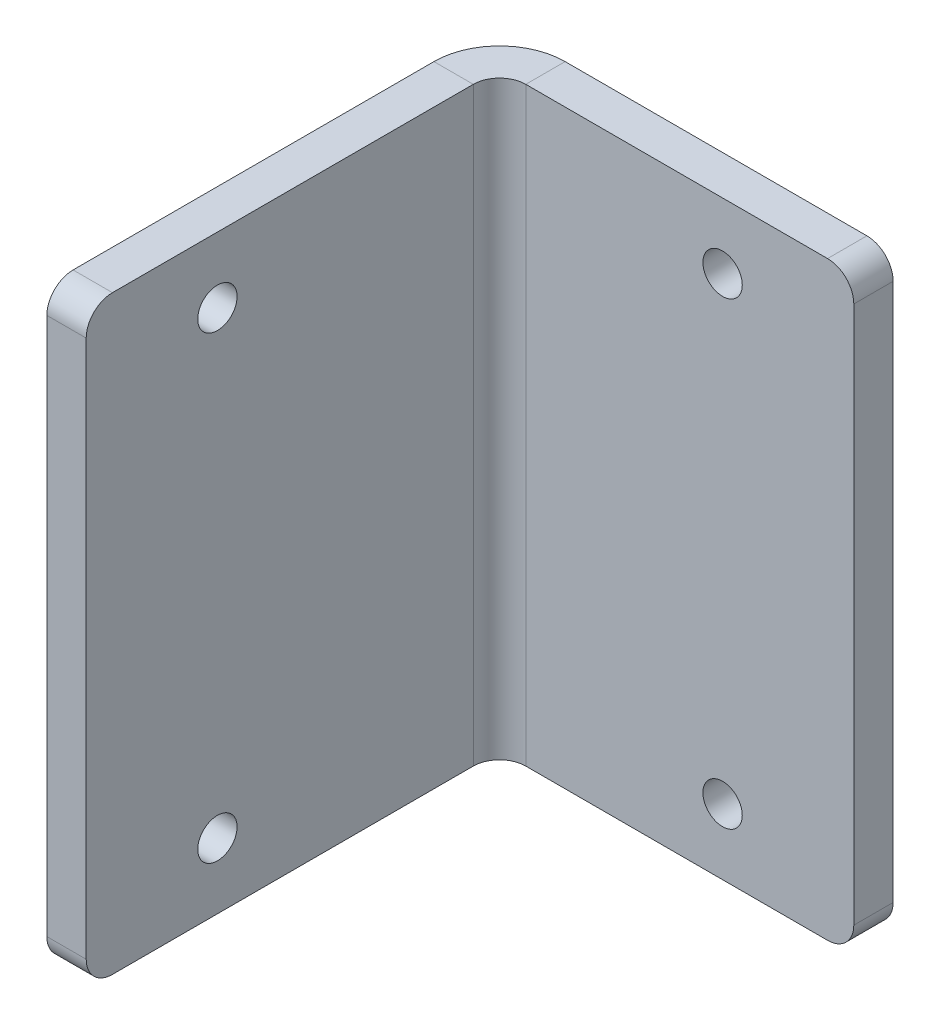
ISO-10303-21;
HEADER;
FILE_DESCRIPTION(('STEP AP214'),'2;1');
FILE_NAME('part.step','',(''),(''),'','','');
FILE_SCHEMA(('AUTOMOTIVE_DESIGN { 1 0 10303 214 1 1 1 1 }'));
ENDSEC;
DATA;
#1=APPLICATION_CONTEXT('core data for automotive mechanical design processes');
#2=APPLICATION_PROTOCOL_DEFINITION('international standard','automotive_design',2000,#1);
#3=PRODUCT_CONTEXT('',#1,'mechanical');
#4=PRODUCT('Part','Part','',(#3));
#5=PRODUCT_RELATED_PRODUCT_CATEGORY('part','',(#4));
#6=PRODUCT_DEFINITION_FORMATION('','',#4);
#7=PRODUCT_DEFINITION_CONTEXT('part definition',#1,'design');
#8=PRODUCT_DEFINITION('design','',#6,#7);
#9=PRODUCT_DEFINITION_SHAPE('','',#8);
#10=(LENGTH_UNIT() NAMED_UNIT(*) SI_UNIT(.MILLI.,.METRE.));
#11=(NAMED_UNIT(*) PLANE_ANGLE_UNIT() SI_UNIT($,.RADIAN.));
#12=(NAMED_UNIT(*) SI_UNIT($,.STERADIAN.) SOLID_ANGLE_UNIT());
#13=UNCERTAINTY_MEASURE_WITH_UNIT(LENGTH_MEASURE(1.E-05),#10,'distance_accuracy_value','');
#14=(GEOMETRIC_REPRESENTATION_CONTEXT(3) GLOBAL_UNCERTAINTY_ASSIGNED_CONTEXT((#13)) GLOBAL_UNIT_ASSIGNED_CONTEXT((#10,
#11,#12)) REPRESENTATION_CONTEXT('',''));
#15=CARTESIAN_POINT('',(0.,0.,0.));
#16=DIRECTION('',(0.,0.,1.));
#17=DIRECTION('',(1.,0.,0.));
#18=AXIS2_PLACEMENT_3D('',#15,#16,#17);
#19=CARTESIAN_POINT('',(33.,45.,34.5022128562178));
#20=DIRECTION('',(0.,-1.,0.));
#21=DIRECTION('',(0.,0.,1.));
#22=AXIS2_PLACEMENT_3D('',#19,#20,#21);
#23=PLANE('',#22);
#24=DIRECTION('',(0.,0.,1.));
#25=VECTOR('',#24,1.);
#26=CARTESIAN_POINT('',(33.,45.,34.5022128562178));
#27=LINE('',#26,#25);
#28=CARTESIAN_POINT('',(32.9999999999999,45.,5.));
#29=VERTEX_POINT('',#28);
#30=CARTESIAN_POINT('',(33.,45.,32.5022128562178));
#31=VERTEX_POINT('',#30);
#32=EDGE_CURVE('E41',#29,#31,#27,.T.);
#33=ORIENTED_EDGE('',*,*,#32,.F.);
#34=DIRECTION('',(-1.,0.,0.));
#35=VECTOR('',#34,1.);
#36=CARTESIAN_POINT('',(32.9999999999999,45.,5.));
#37=LINE('',#36,#35);
#38=CARTESIAN_POINT('',(29.9999999999999,45.,5.00000000000001));
#39=VERTEX_POINT('',#38);
#40=EDGE_CURVE('E12',#29,#39,#37,.T.);
#41=ORIENTED_EDGE('',*,*,#40,.T.);
#42=DIRECTION('',(0.,0.,1.));
#43=VECTOR('',#42,1.);
#44=CARTESIAN_POINT('',(30.,45.,34.5022128562178));
#45=LINE('',#44,#43);
#46=CARTESIAN_POINT('',(30.,45.,32.5022128562178));
#47=VERTEX_POINT('',#46);
#48=EDGE_CURVE('E54',#39,#47,#45,.T.);
#49=ORIENTED_EDGE('',*,*,#48,.T.);
#50=DIRECTION('',(1.,0.,0.));
#51=VECTOR('',#50,1.);
#52=CARTESIAN_POINT('',(33.,45.,32.5022128562178));
#53=LINE('',#52,#51);
#54=EDGE_CURVE('E154',#47,#31,#53,.T.);
#55=ORIENTED_EDGE('',*,*,#54,.T.);
#56=EDGE_LOOP('',(#33,#41,#49,#55));
#57=FACE_BOUND('',#56,.T.);
#58=ADVANCED_FACE('F38',(#57),#23,.F.);
#59=CARTESIAN_POINT('',(33.,0.,34.5022128562178));
#60=DIRECTION('',(0.,1.,0.));
#61=DIRECTION('',(0.,0.,-1.));
#62=AXIS2_PLACEMENT_3D('',#59,#60,#61);
#63=PLANE('',#62);
#64=DIRECTION('',(0.,0.,1.));
#65=VECTOR('',#64,1.);
#66=CARTESIAN_POINT('',(30.,0.,34.5022128562178));
#67=LINE('',#66,#65);
#68=CARTESIAN_POINT('',(30.,0.,32.5022128562178));
#69=VERTEX_POINT('',#68);
#70=CARTESIAN_POINT('',(29.9999999999999,0.,5.00000000000001));
#71=VERTEX_POINT('',#70);
#72=EDGE_CURVE('E61',#69,#71,#67,.F.);
#73=ORIENTED_EDGE('',*,*,#72,.T.);
#74=DIRECTION('',(1.,0.,0.));
#75=VECTOR('',#74,1.);
#76=CARTESIAN_POINT('',(32.9999999999999,0.,5.));
#77=LINE('',#76,#75);
#78=CARTESIAN_POINT('',(32.9999999999999,0.,5.00000000000001));
#79=VERTEX_POINT('',#78);
#80=EDGE_CURVE('E126',#71,#79,#77,.T.);
#81=ORIENTED_EDGE('',*,*,#80,.T.);
#82=DIRECTION('',(0.,0.,-1.));
#83=VECTOR('',#82,1.);
#84=CARTESIAN_POINT('',(33.,0.,34.5022128562178));
#85=LINE('',#84,#83);
#86=CARTESIAN_POINT('',(33.,0.,32.5022128562178));
#87=VERTEX_POINT('',#86);
#88=EDGE_CURVE('E129',#87,#79,#85,.T.);
#89=ORIENTED_EDGE('',*,*,#88,.F.);
#90=DIRECTION('',(1.,0.,0.));
#91=VECTOR('',#90,1.);
#92=CARTESIAN_POINT('',(33.,0.,32.5022128562178));
#93=LINE('',#92,#91);
#94=EDGE_CURVE('E238',#69,#87,#93,.T.);
#95=ORIENTED_EDGE('',*,*,#94,.F.);
#96=EDGE_LOOP('',(#73,#81,#89,#95));
#97=FACE_BOUND('',#96,.T.);
#98=ADVANCED_FACE('F128',(#97),#63,.F.);
#99=CARTESIAN_POINT('',(30.,0.,34.5022128562178));
#100=DIRECTION('',(-1.,0.,0.));
#101=DIRECTION('',(0.,0.,1.));
#102=AXIS2_PLACEMENT_3D('',#99,#100,#101);
#103=PLANE('',#102);
#104=CARTESIAN_POINT('',(30.,4.99999999999773,24.5022128562223));
#105=DIRECTION('',(1.,0.,0.));
#106=DIRECTION('',(0.,0.,-1.));
#107=AXIS2_PLACEMENT_3D('',#104,#105,#106);
#108=CIRCLE('',#107,1.5);
#109=CARTESIAN_POINT('',(30.,4.99999999999773,23.0022128562223));
#110=VERTEX_POINT('',#109);
#111=EDGE_CURVE('E174',#110,#110,#108,.T.);
#112=ORIENTED_EDGE('',*,*,#111,.T.);
#113=EDGE_LOOP('',(#112));
#114=FACE_BOUND('',#113,.T.);
#115=CARTESIAN_POINT('',(30.,39.999999999996,24.5022128562223));
#116=DIRECTION('',(1.,0.,0.));
#117=DIRECTION('',(0.,0.,-1.));
#118=AXIS2_PLACEMENT_3D('',#115,#116,#117);
#119=CIRCLE('',#118,1.5);
#120=CARTESIAN_POINT('',(30.,39.999999999996,23.0022128562223));
#121=VERTEX_POINT('',#120);
#122=EDGE_CURVE('E241',#121,#121,#119,.T.);
#123=ORIENTED_EDGE('',*,*,#122,.T.);
#124=EDGE_LOOP('',(#123));
#125=FACE_BOUND('',#124,.T.);
#126=ORIENTED_EDGE('',*,*,#48,.F.);
#127=DIRECTION('',(0.,-1.,0.));
#128=VECTOR('',#127,1.);
#129=CARTESIAN_POINT('',(29.9999999999999,0.,5.00000000000001));
#130=LINE('',#129,#128);
#131=EDGE_CURVE('E46',#39,#71,#130,.T.);
#132=ORIENTED_EDGE('',*,*,#131,.T.);
#133=ORIENTED_EDGE('',*,*,#72,.F.);
#134=CARTESIAN_POINT('',(30.,2.,32.5022128562178));
#135=DIRECTION('',(-1.,0.,0.));
#136=DIRECTION('',(0.,0.,1.));
#137=AXIS2_PLACEMENT_3D('',#134,#135,#136);
#138=CIRCLE('',#137,2.);
#139=CARTESIAN_POINT('',(30.,2.,34.5022128562178));
#140=VERTEX_POINT('',#139);
#141=EDGE_CURVE('E229',#140,#69,#138,.F.);
#142=ORIENTED_EDGE('',*,*,#141,.F.);
#143=DIRECTION('',(0.,1.,0.));
#144=VECTOR('',#143,1.);
#145=CARTESIAN_POINT('',(30.,0.,34.5022128562178));
#146=LINE('',#145,#144);
#147=CARTESIAN_POINT('',(30.,43.,34.5022128562178));
#148=VERTEX_POINT('',#147);
#149=EDGE_CURVE('E246',#148,#140,#146,.F.);
#150=ORIENTED_EDGE('',*,*,#149,.F.);
#151=CARTESIAN_POINT('',(30.,43.,32.5022128562178));
#152=DIRECTION('',(-1.,0.,0.));
#153=DIRECTION('',(0.,0.,1.));
#154=AXIS2_PLACEMENT_3D('',#151,#152,#153);
#155=CIRCLE('',#154,2.);
#156=EDGE_CURVE('E249',#47,#148,#155,.F.);
#157=ORIENTED_EDGE('',*,*,#156,.F.);
#158=EDGE_LOOP('',(#126,#132,#133,#142,#150,#157));
#159=FACE_BOUND('',#158,.T.);
#160=ADVANCED_FACE('F269',(#114,#125,#159),#103,.T.);
#161=CARTESIAN_POINT('',(33.,43.,32.5022128562178));
#162=DIRECTION('',(-1.,0.,0.));
#163=DIRECTION('',(0.,0.,1.));
#164=AXIS2_PLACEMENT_3D('',#161,#162,#163);
#165=CYLINDRICAL_SURFACE('',#164,2.);
#166=ORIENTED_EDGE('',*,*,#54,.F.);
#167=ORIENTED_EDGE('',*,*,#156,.T.);
#168=DIRECTION('',(1.,0.,0.));
#169=VECTOR('',#168,1.);
#170=CARTESIAN_POINT('',(33.,43.,34.5022128562178));
#171=LINE('',#170,#169);
#172=CARTESIAN_POINT('',(33.,43.,34.5022128562178));
#173=VERTEX_POINT('',#172);
#174=EDGE_CURVE('E255',#148,#173,#171,.T.);
#175=ORIENTED_EDGE('',*,*,#174,.T.);
#176=CARTESIAN_POINT('',(33.,43.,32.5022128562178));
#177=DIRECTION('',(-1.,0.,0.));
#178=DIRECTION('',(0.,0.,1.));
#179=AXIS2_PLACEMENT_3D('',#176,#177,#178);
#180=CIRCLE('',#179,2.);
#181=EDGE_CURVE('E232',#31,#173,#180,.F.);
#182=ORIENTED_EDGE('',*,*,#181,.F.);
#183=EDGE_LOOP('',(#166,#167,#175,#182));
#184=FACE_BOUND('',#183,.T.);
#185=ADVANCED_FACE('F267',(#184),#165,.T.);
#186=CARTESIAN_POINT('',(33.,0.,34.5022128562178));
#187=DIRECTION('',(0.,0.,-1.));
#188=DIRECTION('',(0.,-1.,0.));
#189=AXIS2_PLACEMENT_3D('',#186,#187,#188);
#190=PLANE('',#189);
#191=ORIENTED_EDGE('',*,*,#174,.F.);
#192=ORIENTED_EDGE('',*,*,#149,.T.);
#193=DIRECTION('',(1.,0.,0.));
#194=VECTOR('',#193,1.);
#195=CARTESIAN_POINT('',(33.,2.,34.5022128562178));
#196=LINE('',#195,#194);
#197=CARTESIAN_POINT('',(33.,2.,34.5022128562178));
#198=VERTEX_POINT('',#197);
#199=EDGE_CURVE('E253',#140,#198,#196,.T.);
#200=ORIENTED_EDGE('',*,*,#199,.T.);
#201=DIRECTION('',(0.,-1.,0.));
#202=VECTOR('',#201,1.);
#203=CARTESIAN_POINT('',(33.,0.,34.5022128562178));
#204=LINE('',#203,#202);
#205=EDGE_CURVE('E235',#173,#198,#204,.T.);
#206=ORIENTED_EDGE('',*,*,#205,.F.);
#207=EDGE_LOOP('',(#191,#192,#200,#206));
#208=FACE_BOUND('',#207,.T.);
#209=ADVANCED_FACE('F272',(#208),#190,.F.);
#210=CARTESIAN_POINT('',(33.,2.,32.5022128562178));
#211=DIRECTION('',(-1.,0.,0.));
#212=DIRECTION('',(0.,0.,1.));
#213=AXIS2_PLACEMENT_3D('',#210,#211,#212);
#214=CYLINDRICAL_SURFACE('',#213,2.);
#215=ORIENTED_EDGE('',*,*,#199,.F.);
#216=ORIENTED_EDGE('',*,*,#141,.T.);
#217=ORIENTED_EDGE('',*,*,#94,.T.);
#218=CARTESIAN_POINT('',(33.,2.,32.5022128562178));
#219=DIRECTION('',(-1.,0.,0.));
#220=DIRECTION('',(0.,0.,1.));
#221=AXIS2_PLACEMENT_3D('',#218,#219,#220);
#222=CIRCLE('',#221,2.);
#223=EDGE_CURVE('E144',#198,#87,#222,.F.);
#224=ORIENTED_EDGE('',*,*,#223,.F.);
#225=EDGE_LOOP('',(#215,#216,#217,#224));
#226=FACE_BOUND('',#225,.T.);
#227=ADVANCED_FACE('F282',(#226),#214,.T.);
#228=CARTESIAN_POINT('',(33.,4.99999999999773,24.5022128562223));
#229=DIRECTION('',(1.,0.,0.));
#230=DIRECTION('',(0.,0.,-1.));
#231=AXIS2_PLACEMENT_3D('',#228,#229,#230);
#232=CYLINDRICAL_SURFACE('',#231,1.5);
#233=CARTESIAN_POINT('',(33.,4.99999999999773,24.5022128562223));
#234=DIRECTION('',(1.,0.,0.));
#235=DIRECTION('',(0.,0.,-1.));
#236=AXIS2_PLACEMENT_3D('',#233,#234,#235);
#237=CIRCLE('',#236,1.5);
#238=CARTESIAN_POINT('',(33.,4.99999999999773,23.0022128562223));
#239=VERTEX_POINT('',#238);
#240=EDGE_CURVE('E226',#239,#239,#237,.T.);
#241=ORIENTED_EDGE('',*,*,#240,.T.);
#242=EDGE_LOOP('',(#241));
#243=FACE_BOUND('',#242,.T.);
#244=ORIENTED_EDGE('',*,*,#111,.F.);
#245=EDGE_LOOP('',(#244));
#246=FACE_BOUND('',#245,.T.);
#247=ADVANCED_FACE('F284',(#243,#246),#232,.F.);
#248=CARTESIAN_POINT('',(33.,39.999999999996,24.5022128562223));
#249=DIRECTION('',(1.,0.,0.));
#250=DIRECTION('',(0.,0.,-1.));
#251=AXIS2_PLACEMENT_3D('',#248,#249,#250);
#252=CYLINDRICAL_SURFACE('',#251,1.5);
#253=CARTESIAN_POINT('',(33.,39.999999999996,24.5022128562223));
#254=DIRECTION('',(1.,0.,0.));
#255=DIRECTION('',(0.,0.,-1.));
#256=AXIS2_PLACEMENT_3D('',#253,#254,#255);
#257=CIRCLE('',#256,1.5);
#258=CARTESIAN_POINT('',(33.,39.999999999996,23.0022128562223));
#259=VERTEX_POINT('',#258);
#260=EDGE_CURVE('E145',#259,#259,#257,.T.);
#261=ORIENTED_EDGE('',*,*,#260,.T.);
#262=EDGE_LOOP('',(#261));
#263=FACE_BOUND('',#262,.T.);
#264=ORIENTED_EDGE('',*,*,#122,.F.);
#265=EDGE_LOOP('',(#264));
#266=FACE_BOUND('',#265,.T.);
#267=ADVANCED_FACE('F290',(#263,#266),#252,.F.);
#268=CARTESIAN_POINT('',(33.,0.,34.5022128562178));
#269=DIRECTION('',(-1.,0.,0.));
#270=DIRECTION('',(0.,0.,1.));
#271=AXIS2_PLACEMENT_3D('',#268,#269,#270);
#272=PLANE('',#271);
#273=DIRECTION('',(0.,-1.,0.));
#274=VECTOR('',#273,1.);
#275=CARTESIAN_POINT('',(32.9999999999999,0.,5.));
#276=LINE('',#275,#274);
#277=EDGE_CURVE('E135',#29,#79,#276,.T.);
#278=ORIENTED_EDGE('',*,*,#277,.F.);
#279=ORIENTED_EDGE('',*,*,#32,.T.);
#280=ORIENTED_EDGE('',*,*,#181,.T.);
#281=ORIENTED_EDGE('',*,*,#205,.T.);
#282=ORIENTED_EDGE('',*,*,#223,.T.);
#283=ORIENTED_EDGE('',*,*,#88,.T.);
#284=EDGE_LOOP('',(#278,#279,#280,#281,#282,#283));
#285=FACE_BOUND('',#284,.T.);
#286=ORIENTED_EDGE('',*,*,#240,.F.);
#287=EDGE_LOOP('',(#286));
#288=FACE_BOUND('',#287,.T.);
#289=ORIENTED_EDGE('',*,*,#260,.F.);
#290=EDGE_LOOP('',(#289));
#291=FACE_BOUND('',#290,.T.);
#292=ADVANCED_FACE('F139',(#285,#288,#291),#272,.F.);
#293=CARTESIAN_POINT('',(57.9999999999999,43.,3.));
#294=DIRECTION('',(0.,0.,-1.));
#295=DIRECTION('',(-1.,0.,0.));
#296=AXIS2_PLACEMENT_3D('',#293,#294,#295);
#297=CYLINDRICAL_SURFACE('',#296,2.);
#298=DIRECTION('',(0.,0.,1.));
#299=VECTOR('',#298,1.);
#300=CARTESIAN_POINT('',(59.9999999999999,43.,3.));
#301=LINE('',#300,#299);
#302=CARTESIAN_POINT('',(59.9999999999999,43.,0.));
#303=VERTEX_POINT('',#302);
#304=CARTESIAN_POINT('',(59.9999999999999,43.,3.));
#305=VERTEX_POINT('',#304);
#306=EDGE_CURVE('E213',#303,#305,#301,.T.);
#307=ORIENTED_EDGE('',*,*,#306,.F.);
#308=CARTESIAN_POINT('',(57.9999999999999,43.,0.));
#309=DIRECTION('',(0.,0.,-1.));
#310=DIRECTION('',(-1.,0.,0.));
#311=AXIS2_PLACEMENT_3D('',#308,#309,#310);
#312=CIRCLE('',#311,2.);
#313=CARTESIAN_POINT('',(57.9999999999999,45.,0.));
#314=VERTEX_POINT('',#313);
#315=EDGE_CURVE('E220',#303,#314,#312,.F.);
#316=ORIENTED_EDGE('',*,*,#315,.T.);
#317=DIRECTION('',(0.,0.,1.));
#318=VECTOR('',#317,1.);
#319=CARTESIAN_POINT('',(57.9999999999999,45.,3.));
#320=LINE('',#319,#318);
#321=CARTESIAN_POINT('',(57.9999999999999,45.,3.));
#322=VERTEX_POINT('',#321);
#323=EDGE_CURVE('E218',#314,#322,#320,.T.);
#324=ORIENTED_EDGE('',*,*,#323,.T.);
#325=CARTESIAN_POINT('',(57.9999999999999,43.,3.));
#326=DIRECTION('',(0.,0.,-1.));
#327=DIRECTION('',(-1.,0.,0.));
#328=AXIS2_PLACEMENT_3D('',#325,#326,#327);
#329=CIRCLE('',#328,2.);
#330=EDGE_CURVE('E186',#305,#322,#329,.F.);
#331=ORIENTED_EDGE('',*,*,#330,.F.);
#332=EDGE_LOOP('',(#307,#316,#324,#331));
#333=FACE_BOUND('',#332,.T.);
#334=ADVANCED_FACE('F309',(#333),#297,.T.);
#335=CARTESIAN_POINT('',(59.9999999999999,0.,3.));
#336=DIRECTION('',(-1.,0.,0.));
#337=DIRECTION('',(0.,1.,0.));
#338=AXIS2_PLACEMENT_3D('',#335,#336,#337);
#339=PLANE('',#338);
#340=DIRECTION('',(0.,0.,1.));
#341=VECTOR('',#340,1.);
#342=CARTESIAN_POINT('',(59.9999999999999,2.,3.));
#343=LINE('',#342,#341);
#344=CARTESIAN_POINT('',(59.9999999999999,2.,0.));
#345=VERTEX_POINT('',#344);
#346=CARTESIAN_POINT('',(59.9999999999999,2.,3.));
#347=VERTEX_POINT('',#346);
#348=EDGE_CURVE('E208',#345,#347,#343,.T.);
#349=ORIENTED_EDGE('',*,*,#348,.F.);
#350=DIRECTION('',(0.,1.,0.));
#351=VECTOR('',#350,1.);
#352=CARTESIAN_POINT('',(59.9999999999999,0.,0.));
#353=LINE('',#352,#351);
#354=EDGE_CURVE('E215',#345,#303,#353,.T.);
#355=ORIENTED_EDGE('',*,*,#354,.T.);
#356=ORIENTED_EDGE('',*,*,#306,.T.);
#357=DIRECTION('',(0.,1.,0.));
#358=VECTOR('',#357,1.);
#359=CARTESIAN_POINT('',(59.9999999999999,0.,3.));
#360=LINE('',#359,#358);
#361=EDGE_CURVE('E189',#347,#305,#360,.T.);
#362=ORIENTED_EDGE('',*,*,#361,.F.);
#363=EDGE_LOOP('',(#349,#355,#356,#362));
#364=FACE_BOUND('',#363,.T.);
#365=ADVANCED_FACE('F355',(#364),#339,.F.);
#366=CARTESIAN_POINT('',(57.9999999999999,2.,3.));
#367=DIRECTION('',(0.,0.,-1.));
#368=DIRECTION('',(-1.,0.,0.));
#369=AXIS2_PLACEMENT_3D('',#366,#367,#368);
#370=CYLINDRICAL_SURFACE('',#369,2.);
#371=CARTESIAN_POINT('',(57.9999999999999,2.,0.));
#372=DIRECTION('',(0.,0.,-1.));
#373=DIRECTION('',(-1.,0.,0.));
#374=AXIS2_PLACEMENT_3D('',#371,#372,#373);
#375=CIRCLE('',#374,2.);
#376=CARTESIAN_POINT('',(57.9999999999999,0.,0.));
#377=VERTEX_POINT('',#376);
#378=EDGE_CURVE('E210',#377,#345,#375,.F.);
#379=ORIENTED_EDGE('',*,*,#378,.T.);
#380=ORIENTED_EDGE('',*,*,#348,.T.);
#381=CARTESIAN_POINT('',(57.9999999999999,2.,3.));
#382=DIRECTION('',(0.,0.,-1.));
#383=DIRECTION('',(-1.,0.,0.));
#384=AXIS2_PLACEMENT_3D('',#381,#382,#383);
#385=CIRCLE('',#384,2.);
#386=CARTESIAN_POINT('',(57.9999999999999,0.,3.));
#387=VERTEX_POINT('',#386);
#388=EDGE_CURVE('E192',#387,#347,#385,.F.);
#389=ORIENTED_EDGE('',*,*,#388,.F.);
#390=DIRECTION('',(0.,0.,1.));
#391=VECTOR('',#390,1.);
#392=CARTESIAN_POINT('',(57.9999999999999,0.,3.));
#393=LINE('',#392,#391);
#394=EDGE_CURVE('E181',#377,#387,#393,.T.);
#395=ORIENTED_EDGE('',*,*,#394,.F.);
#396=EDGE_LOOP('',(#379,#380,#389,#395));
#397=FACE_BOUND('',#396,.T.);
#398=ADVANCED_FACE('F367',(#397),#370,.T.);
#399=CARTESIAN_POINT('',(50.0000000000085,5.,3.));
#400=DIRECTION('',(0.,0.,1.));
#401=DIRECTION('',(1.,0.,0.));
#402=AXIS2_PLACEMENT_3D('',#399,#400,#401);
#403=CYLINDRICAL_SURFACE('',#402,1.5);
#404=CARTESIAN_POINT('',(50.0000000000085,5.,3.));
#405=DIRECTION('',(0.,0.,1.));
#406=DIRECTION('',(1.,0.,0.));
#407=AXIS2_PLACEMENT_3D('',#404,#405,#406);
#408=CIRCLE('',#407,1.5);
#409=CARTESIAN_POINT('',(51.5000000000085,5.,3.));
#410=VERTEX_POINT('',#409);
#411=EDGE_CURVE('E205',#410,#410,#408,.T.);
#412=ORIENTED_EDGE('',*,*,#411,.T.);
#413=EDGE_LOOP('',(#412));
#414=FACE_BOUND('',#413,.T.);
#415=CARTESIAN_POINT('',(50.0000000000085,5.,0.));
#416=DIRECTION('',(0.,0.,1.));
#417=DIRECTION('',(1.,0.,0.));
#418=AXIS2_PLACEMENT_3D('',#415,#416,#417);
#419=CIRCLE('',#418,1.5);
#420=CARTESIAN_POINT('',(51.5000000000085,5.,0.));
#421=VERTEX_POINT('',#420);
#422=EDGE_CURVE('E178',#421,#421,#419,.T.);
#423=ORIENTED_EDGE('',*,*,#422,.F.);
#424=EDGE_LOOP('',(#423));
#425=FACE_BOUND('',#424,.T.);
#426=ADVANCED_FACE('F378',(#414,#425),#403,.F.);
#427=CARTESIAN_POINT('',(50.0000000000056,39.999999999996,3.));
#428=DIRECTION('',(0.,0.,1.));
#429=DIRECTION('',(1.,0.,0.));
#430=AXIS2_PLACEMENT_3D('',#427,#428,#429);
#431=CYLINDRICAL_SURFACE('',#430,1.5);
#432=CARTESIAN_POINT('',(50.0000000000056,39.999999999996,3.));
#433=DIRECTION('',(0.,0.,1.));
#434=DIRECTION('',(1.,0.,0.));
#435=AXIS2_PLACEMENT_3D('',#432,#433,#434);
#436=CIRCLE('',#435,1.5);
#437=CARTESIAN_POINT('',(51.5000000000057,39.999999999996,3.));
#438=VERTEX_POINT('',#437);
#439=EDGE_CURVE('E202',#438,#438,#436,.T.);
#440=ORIENTED_EDGE('',*,*,#439,.T.);
#441=EDGE_LOOP('',(#440));
#442=FACE_BOUND('',#441,.T.);
#443=CARTESIAN_POINT('',(50.0000000000056,39.999999999996,0.));
#444=DIRECTION('',(0.,0.,1.));
#445=DIRECTION('',(1.,0.,0.));
#446=AXIS2_PLACEMENT_3D('',#443,#444,#445);
#447=CIRCLE('',#446,1.5);
#448=CARTESIAN_POINT('',(51.5000000000057,39.999999999996,0.));
#449=VERTEX_POINT('',#448);
#450=EDGE_CURVE('E175',#449,#449,#447,.T.);
#451=ORIENTED_EDGE('',*,*,#450,.F.);
#452=EDGE_LOOP('',(#451));
#453=FACE_BOUND('',#452,.T.);
#454=ADVANCED_FACE('F389',(#442,#453),#431,.F.);
#455=CARTESIAN_POINT('',(0.,0.,3.));
#456=DIRECTION('',(0.,0.,-1.));
#457=DIRECTION('',(-1.,0.,0.));
#458=AXIS2_PLACEMENT_3D('',#455,#456,#457);
#459=PLANE('',#458);
#460=ORIENTED_EDGE('',*,*,#439,.F.);
#461=EDGE_LOOP('',(#460));
#462=FACE_BOUND('',#461,.T.);
#463=ORIENTED_EDGE('',*,*,#411,.F.);
#464=EDGE_LOOP('',(#463));
#465=FACE_BOUND('',#464,.T.);
#466=DIRECTION('',(-1.,0.,0.));
#467=VECTOR('',#466,1.);
#468=CARTESIAN_POINT('',(0.,45.,3.));
#469=LINE('',#468,#467);
#470=CARTESIAN_POINT('',(34.9999999999999,45.,3.));
#471=VERTEX_POINT('',#470);
#472=EDGE_CURVE('E200',#322,#471,#469,.T.);
#473=ORIENTED_EDGE('',*,*,#472,.T.);
#474=DIRECTION('',(0.,-1.,0.));
#475=VECTOR('',#474,1.);
#476=CARTESIAN_POINT('',(34.9999999999999,0.,3.));
#477=LINE('',#476,#475);
#478=CARTESIAN_POINT('',(34.9999999999999,0.,3.));
#479=VERTEX_POINT('',#478);
#480=EDGE_CURVE('E197',#471,#479,#477,.T.);
#481=ORIENTED_EDGE('',*,*,#480,.T.);
#482=DIRECTION('',(1.,0.,0.));
#483=VECTOR('',#482,1.);
#484=CARTESIAN_POINT('',(0.,0.,3.));
#485=LINE('',#484,#483);
#486=EDGE_CURVE('E195',#479,#387,#485,.T.);
#487=ORIENTED_EDGE('',*,*,#486,.T.);
#488=ORIENTED_EDGE('',*,*,#388,.T.);
#489=ORIENTED_EDGE('',*,*,#361,.T.);
#490=ORIENTED_EDGE('',*,*,#330,.T.);
#491=EDGE_LOOP('',(#473,#481,#487,#488,#489,#490));
#492=FACE_BOUND('',#491,.T.);
#493=ADVANCED_FACE('F400',(#462,#465,#492),#459,.F.);
#494=CARTESIAN_POINT('',(0.,0.,3.));
#495=DIRECTION('',(0.,1.,0.));
#496=DIRECTION('',(1.,0.,0.));
#497=AXIS2_PLACEMENT_3D('',#494,#495,#496);
#498=PLANE('',#497);
#499=DIRECTION('',(0.,0.,1.));
#500=VECTOR('',#499,1.);
#501=CARTESIAN_POINT('',(34.9999999999999,0.,3.));
#502=LINE('',#501,#500);
#503=CARTESIAN_POINT('',(34.9999999999999,0.,0.));
#504=VERTEX_POINT('',#503);
#505=EDGE_CURVE('E159',#504,#479,#502,.T.);
#506=ORIENTED_EDGE('',*,*,#505,.F.);
#507=DIRECTION('',(-1.,0.,0.));
#508=VECTOR('',#507,1.);
#509=CARTESIAN_POINT('',(0.,0.,0.));
#510=LINE('',#509,#508);
#511=EDGE_CURVE('E184',#504,#377,#510,.F.);
#512=ORIENTED_EDGE('',*,*,#511,.T.);
#513=ORIENTED_EDGE('',*,*,#394,.T.);
#514=ORIENTED_EDGE('',*,*,#486,.F.);
#515=EDGE_LOOP('',(#506,#512,#513,#514));
#516=FACE_BOUND('',#515,.T.);
#517=ADVANCED_FACE('F411',(#516),#498,.F.);
#518=CARTESIAN_POINT('',(0.,0.,0.));
#519=DIRECTION('',(0.,0.,-1.));
#520=DIRECTION('',(-1.,0.,0.));
#521=AXIS2_PLACEMENT_3D('',#518,#519,#520);
#522=PLANE('',#521);
#523=DIRECTION('',(0.,-1.,0.));
#524=VECTOR('',#523,1.);
#525=CARTESIAN_POINT('',(34.9999999999999,0.,0.));
#526=LINE('',#525,#524);
#527=CARTESIAN_POINT('',(34.9999999999999,45.,0.));
#528=VERTEX_POINT('',#527);
#529=EDGE_CURVE('E163',#528,#504,#526,.T.);
#530=ORIENTED_EDGE('',*,*,#529,.F.);
#531=DIRECTION('',(-1.,0.,0.));
#532=VECTOR('',#531,1.);
#533=CARTESIAN_POINT('',(0.,45.,0.));
#534=LINE('',#533,#532);
#535=EDGE_CURVE('E172',#314,#528,#534,.T.);
#536=ORIENTED_EDGE('',*,*,#535,.F.);
#537=ORIENTED_EDGE('',*,*,#315,.F.);
#538=ORIENTED_EDGE('',*,*,#354,.F.);
#539=ORIENTED_EDGE('',*,*,#378,.F.);
#540=ORIENTED_EDGE('',*,*,#511,.F.);
#541=EDGE_LOOP('',(#530,#536,#537,#538,#539,#540));
#542=FACE_BOUND('',#541,.T.);
#543=ORIENTED_EDGE('',*,*,#422,.T.);
#544=EDGE_LOOP('',(#543));
#545=FACE_BOUND('',#544,.T.);
#546=ORIENTED_EDGE('',*,*,#450,.T.);
#547=EDGE_LOOP('',(#546));
#548=FACE_BOUND('',#547,.T.);
#549=ADVANCED_FACE('F420',(#542,#545,#548),#522,.T.);
#550=CARTESIAN_POINT('',(0.,45.,3.));
#551=DIRECTION('',(0.,-1.,0.));
#552=DIRECTION('',(-1.,0.,0.));
#553=AXIS2_PLACEMENT_3D('',#550,#551,#552);
#554=PLANE('',#553);
#555=DIRECTION('',(0.,0.,-1.));
#556=VECTOR('',#555,1.);
#557=CARTESIAN_POINT('',(34.9999999999999,45.,3.));
#558=LINE('',#557,#556);
#559=EDGE_CURVE('E160',#471,#528,#558,.T.);
#560=ORIENTED_EDGE('',*,*,#559,.F.);
#561=ORIENTED_EDGE('',*,*,#472,.F.);
#562=ORIENTED_EDGE('',*,*,#323,.F.);
#563=ORIENTED_EDGE('',*,*,#535,.T.);
#564=EDGE_LOOP('',(#560,#561,#562,#563));
#565=FACE_BOUND('',#564,.T.);
#566=ADVANCED_FACE('F432',(#565),#554,.F.);
#567=CARTESIAN_POINT('',(34.9999999999999,45.,5.));
#568=DIRECTION('',(0.,-1.,0.));
#569=DIRECTION('',(0.,0.,-1.));
#570=AXIS2_PLACEMENT_3D('',#567,#568,#569);
#571=PLANE('',#570);
#572=ORIENTED_EDGE('',*,*,#559,.T.);
#573=CARTESIAN_POINT('',(34.9999999999999,45.,5.));
#574=DIRECTION('',(0.,-1.,0.));
#575=DIRECTION('',(1.,0.,0.));
#576=AXIS2_PLACEMENT_3D('',#573,#574,#575);
#577=CIRCLE('',#576,5.);
#578=EDGE_CURVE('E169',#528,#39,#577,.F.);
#579=ORIENTED_EDGE('',*,*,#578,.T.);
#580=ORIENTED_EDGE('',*,*,#40,.F.);
#581=CARTESIAN_POINT('',(34.9999999999999,45.,5.));
#582=DIRECTION('',(0.,1.,0.));
#583=DIRECTION('',(0.,0.,1.));
#584=AXIS2_PLACEMENT_3D('',#581,#582,#583);
#585=CIRCLE('',#584,2.);
#586=EDGE_CURVE('E153',#471,#29,#585,.T.);
#587=ORIENTED_EDGE('',*,*,#586,.F.);
#588=EDGE_LOOP('',(#572,#579,#580,#587));
#589=FACE_BOUND('',#588,.T.);
#590=ADVANCED_FACE('F275',(#589),#571,.F.);
#591=CARTESIAN_POINT('',(34.9999999999999,0.,5.));
#592=DIRECTION('',(0.,1.,0.));
#593=DIRECTION('',(-1.,0.,0.));
#594=AXIS2_PLACEMENT_3D('',#591,#592,#593);
#595=PLANE('',#594);
#596=ORIENTED_EDGE('',*,*,#80,.F.);
#597=CARTESIAN_POINT('',(34.9999999999999,0.,5.));
#598=DIRECTION('',(0.,-1.,0.));
#599=DIRECTION('',(1.,0.,0.));
#600=AXIS2_PLACEMENT_3D('',#597,#598,#599);
#601=CIRCLE('',#600,5.);
#602=EDGE_CURVE('E165',#71,#504,#601,.T.);
#603=ORIENTED_EDGE('',*,*,#602,.T.);
#604=ORIENTED_EDGE('',*,*,#505,.T.);
#605=CARTESIAN_POINT('',(34.9999999999999,0.,5.));
#606=DIRECTION('',(0.,-1.,0.));
#607=DIRECTION('',(1.,0.,0.));
#608=AXIS2_PLACEMENT_3D('',#605,#606,#607);
#609=CIRCLE('',#608,2.);
#610=EDGE_CURVE('E151',#79,#479,#609,.T.);
#611=ORIENTED_EDGE('',*,*,#610,.F.);
#612=EDGE_LOOP('',(#596,#603,#604,#611));
#613=FACE_BOUND('',#612,.T.);
#614=ADVANCED_FACE('F157',(#613),#595,.F.);
#615=CARTESIAN_POINT('',(34.9999999999999,67.9337502686971,5.));
#616=DIRECTION('',(0.,-1.,0.));
#617=DIRECTION('',(1.,0.,0.));
#618=AXIS2_PLACEMENT_3D('',#615,#616,#617);
#619=CYLINDRICAL_SURFACE('',#618,2.);
#620=ORIENTED_EDGE('',*,*,#610,.T.);
#621=ORIENTED_EDGE('',*,*,#480,.F.);
#622=ORIENTED_EDGE('',*,*,#586,.T.);
#623=ORIENTED_EDGE('',*,*,#277,.T.);
#624=EDGE_LOOP('',(#620,#621,#622,#623));
#625=FACE_BOUND('',#624,.T.);
#626=ADVANCED_FACE('F149',(#625),#619,.F.);
#627=CARTESIAN_POINT('',(34.9999999999999,67.9337502686971,5.));
#628=DIRECTION('',(0.,-1.,0.));
#629=DIRECTION('',(1.,0.,0.));
#630=AXIS2_PLACEMENT_3D('',#627,#628,#629);
#631=CYLINDRICAL_SURFACE('',#630,5.);
#632=ORIENTED_EDGE('',*,*,#602,.F.);
#633=ORIENTED_EDGE('',*,*,#131,.F.);
#634=ORIENTED_EDGE('',*,*,#578,.F.);
#635=ORIENTED_EDGE('',*,*,#529,.T.);
#636=EDGE_LOOP('',(#632,#633,#634,#635));
#637=FACE_BOUND('',#636,.T.);
#638=ADVANCED_FACE('F279',(#637),#631,.T.);
#639=CLOSED_SHELL('',(#58,#98,#160,#185,#209,#227,#247,#267,#292,#334,#365,#398,#426,#454,#493,
#517,#549,#566,#590,#614,#626,#638));
#640=MANIFOLD_SOLID_BREP('B2',#639);
#641=ADVANCED_BREP_SHAPE_REPRESENTATION('',(#18,#640),#14);
#642=SHAPE_DEFINITION_REPRESENTATION(#9,#641);
ENDSEC;
END-ISO-10303-21;
